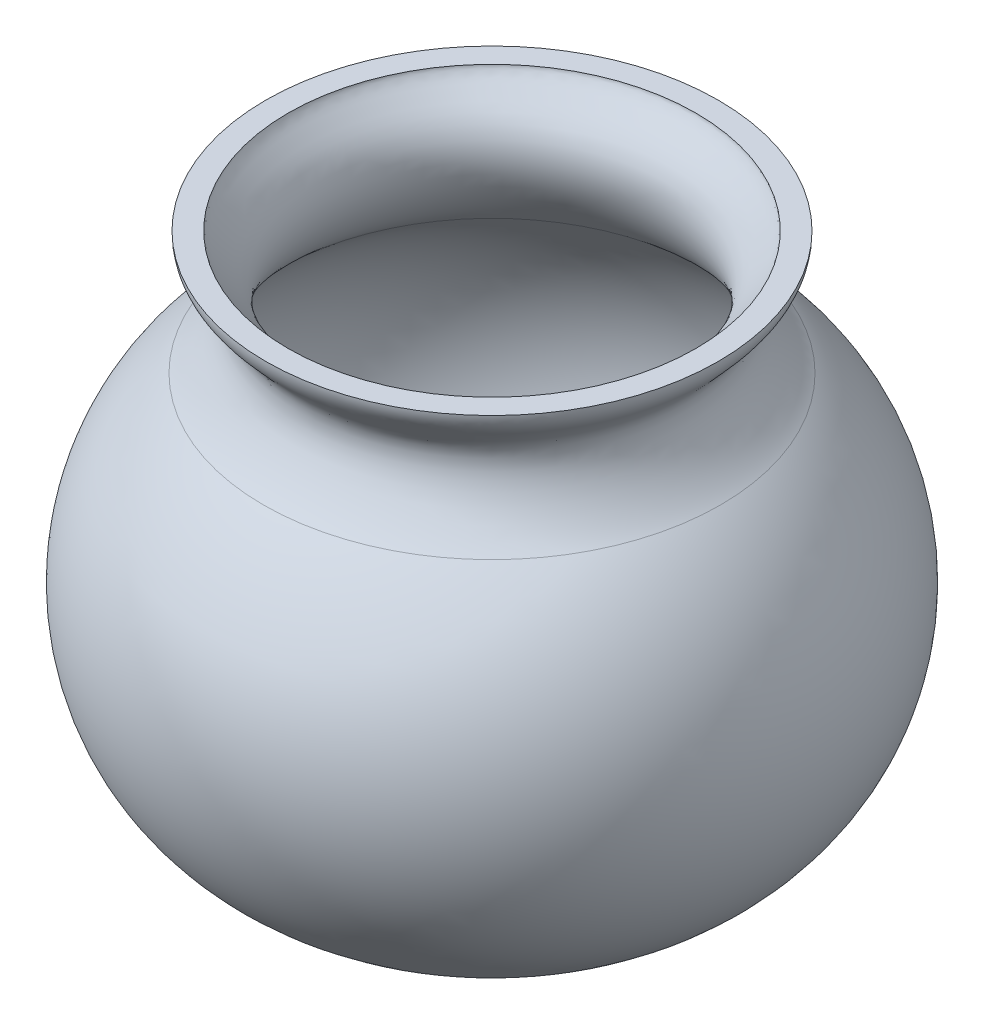
ISO-10303-21;
HEADER;
FILE_DESCRIPTION(('STEP AP214'),'2;1');
FILE_NAME('part.step','',(''),(''),'','','');
FILE_SCHEMA(('AUTOMOTIVE_DESIGN { 1 0 10303 214 1 1 1 1 }'));
ENDSEC;
DATA;
#1=APPLICATION_CONTEXT('core data for automotive mechanical design processes');
#2=APPLICATION_PROTOCOL_DEFINITION('international standard','automotive_design',2000,#1);
#3=PRODUCT_CONTEXT('',#1,'mechanical');
#4=PRODUCT('Part','Part','',(#3));
#5=PRODUCT_RELATED_PRODUCT_CATEGORY('part','',(#4));
#6=PRODUCT_DEFINITION_FORMATION('','',#4);
#7=PRODUCT_DEFINITION_CONTEXT('part definition',#1,'design');
#8=PRODUCT_DEFINITION('design','',#6,#7);
#9=PRODUCT_DEFINITION_SHAPE('','',#8);
#10=(LENGTH_UNIT() NAMED_UNIT(*) SI_UNIT(.MILLI.,.METRE.));
#11=(NAMED_UNIT(*) PLANE_ANGLE_UNIT() SI_UNIT($,.RADIAN.));
#12=(NAMED_UNIT(*) SI_UNIT($,.STERADIAN.) SOLID_ANGLE_UNIT());
#13=UNCERTAINTY_MEASURE_WITH_UNIT(LENGTH_MEASURE(1.E-05),#10,'distance_accuracy_value','');
#14=(GEOMETRIC_REPRESENTATION_CONTEXT(3) GLOBAL_UNCERTAINTY_ASSIGNED_CONTEXT((#13)) GLOBAL_UNIT_ASSIGNED_CONTEXT((#10,
#11,#12)) REPRESENTATION_CONTEXT('',''));
#15=CARTESIAN_POINT('',(0.,0.,0.));
#16=DIRECTION('',(0.,0.,1.));
#17=DIRECTION('',(1.,0.,0.));
#18=AXIS2_PLACEMENT_3D('',#15,#16,#17);
#19=CARTESIAN_POINT('',(17.8417265439225,8.55348735510455,0.));
#20=CARTESIAN_POINT('',(16.3632375000152,9.74064931341441,0.));
#21=CARTESIAN_POINT('',(13.0541570451045,14.3831337431374,0.));
#22=CARTESIAN_POINT('',(17.6760307928761,16.5435492169534,0.));
#23=CARTESIAN_POINT('',(17.6760307928761,18.1852693453129,0.));
#24=B_SPLINE_CURVE_WITH_KNOTS('',3,(#19,#20,#21,#22,#23),.UNSPECIFIED.,.F.,.F.,(4,1,4),(0.,
0.574289637950988,1.),.UNSPECIFIED.);
#25=CARTESIAN_POINT('',(0.,58.5220793921878,0.));
#26=DIRECTION('',(0.,1.,0.));
#27=AXIS1_PLACEMENT('',#25,#26);
#28=SURFACE_OF_REVOLUTION('',#24,#27);
#29=CARTESIAN_POINT('',(0.,18.1852693453129,0.));
#30=DIRECTION('',(0.,1.,0.));
#31=DIRECTION('',(0.,0.,1.));
#32=AXIS2_PLACEMENT_3D('',#29,#30,#31);
#33=CIRCLE('',#32,17.6760307928761);
#34=CARTESIAN_POINT('',(0.,18.1852693453129,17.6760307928761));
#35=VERTEX_POINT('',#34);
#36=EDGE_CURVE('E10',#35,#35,#33,.T.);
#37=ORIENTED_EDGE('',*,*,#36,.F.);
#38=EDGE_LOOP('',(#37));
#39=FACE_BOUND('',#38,.T.);
#40=CARTESIAN_POINT('',(0.,8.55348735510455,0.));
#41=DIRECTION('',(0.,1.,0.));
#42=DIRECTION('',(0.,0.,1.));
#43=AXIS2_PLACEMENT_3D('',#40,#41,#42);
#44=CIRCLE('',#43,17.8417265439225);
#45=CARTESIAN_POINT('',(0.,8.55348735510455,17.8417265439225));
#46=VERTEX_POINT('',#45);
#47=EDGE_CURVE('E56',#46,#46,#44,.T.);
#48=ORIENTED_EDGE('',*,*,#47,.T.);
#49=EDGE_LOOP('',(#48));
#50=FACE_BOUND('',#49,.T.);
#51=ADVANCED_FACE('F33',(#39,#50),#28,.T.);
#52=CARTESIAN_POINT('',(15.9260307928761,18.1852693453129,0.));
#53=DIRECTION('',(0.,-1.,0.));
#54=DIRECTION('',(0.,0.,-1.));
#55=AXIS2_PLACEMENT_3D('',#52,#53,#54);
#56=PLANE('',#55);
#57=CARTESIAN_POINT('',(0.,18.1852693453129,0.));
#58=DIRECTION('',(0.,1.,0.));
#59=DIRECTION('',(0.,0.,1.));
#60=AXIS2_PLACEMENT_3D('',#57,#58,#59);
#61=CIRCLE('',#60,15.9260307928761);
#62=CARTESIAN_POINT('',(0.,18.1852693453129,15.9260307928761));
#63=VERTEX_POINT('',#62);
#64=EDGE_CURVE('E40',#63,#63,#61,.T.);
#65=ORIENTED_EDGE('',*,*,#64,.F.);
#66=EDGE_LOOP('',(#65));
#67=FACE_BOUND('',#66,.T.);
#68=ORIENTED_EDGE('',*,*,#36,.T.);
#69=EDGE_LOOP('',(#68));
#70=FACE_BOUND('',#69,.T.);
#71=ADVANCED_FACE('F75',(#67,#70),#56,.F.);
#72=CARTESIAN_POINT('',(15.9260307928761,18.1852693453129,0.));
#73=CARTESIAN_POINT('',(15.9260307928761,18.1490058291508,0.));
#74=CARTESIAN_POINT('',(15.9221207805379,18.1050170049717,0.));
#75=CARTESIAN_POINT('',(15.8201107027381,17.878855971998,0.));
#76=CARTESIAN_POINT('',(15.5280638653373,17.5011950048872,0.));
#77=CARTESIAN_POINT('',(15.0771484340742,17.0245709720904,0.));
#78=CARTESIAN_POINT('',(14.5265603514551,16.4439110706267,0.));
#79=CARTESIAN_POINT('',(13.9428632410795,15.7270624084047,0.));
#80=CARTESIAN_POINT('',(13.4150785368072,14.695626089205,0.));
#81=CARTESIAN_POINT('',(13.2326041662355,13.5640042034424,0.));
#82=CARTESIAN_POINT('',(13.316734427845,12.5197450245464,0.));
#83=CARTESIAN_POINT('',(13.6628032678733,11.2286412969883,0.));
#84=CARTESIAN_POINT('',(14.396139635518,9.78857024572781,0.));
#85=CARTESIAN_POINT('',(15.3295728499585,8.55560500564795,0.));
#86=CARTESIAN_POINT('',(16.132410921106,7.71592769770157,0.));
#87=CARTESIAN_POINT('',(16.5330490396721,7.35996918805183,0.));
#88=CARTESIAN_POINT('',(16.7460522884572,7.18893690682113,0.));
#89=B_SPLINE_CURVE_WITH_KNOTS('',3,(#72,#73,#74,#75,#76,#77,#78,#79,#80,#81,#82,#83,#84,#85,#86,
#87,#88),.UNSPECIFIED.,.F.,.F.,(4,1,1,1,1,1,1,1,1,1,1,1,1,1,4),(0.,0.0625,0.125,0.1875,0.25,
0.3125,0.375,0.4375,0.5,0.5625,0.625,0.75,0.875,0.9375,1.),.UNSPECIFIED.);
#90=CARTESIAN_POINT('',(0.,58.5220793921878,0.));
#91=DIRECTION('',(0.,1.,0.));
#92=AXIS1_PLACEMENT('',#90,#91);
#93=SURFACE_OF_REVOLUTION('',#89,#92);
#94=CARTESIAN_POINT('',(0.,7.18893690682112,0.));
#95=DIRECTION('',(0.,1.,0.));
#96=DIRECTION('',(0.,0.,1.));
#97=AXIS2_PLACEMENT_3D('',#94,#95,#96);
#98=CIRCLE('',#97,16.7460522884572);
#99=CARTESIAN_POINT('',(0.,7.18893690682112,16.7460522884572));
#100=VERTEX_POINT('',#99);
#101=EDGE_CURVE('E44',#100,#100,#98,.T.);
#102=ORIENTED_EDGE('',*,*,#101,.F.);
#103=EDGE_LOOP('',(#102));
#104=FACE_BOUND('',#103,.T.);
#105=ORIENTED_EDGE('',*,*,#64,.T.);
#106=EDGE_LOOP('',(#105));
#107=FACE_BOUND('',#106,.T.);
#108=ADVANCED_FACE('F71',(#104,#107),#93,.T.);
#109=CARTESIAN_POINT('',(0.,-5.57540363425461,0.));
#110=DIRECTION('',(0.,1.,0.));
#111=DIRECTION('',(0.,0.,1.));
#112=AXIS2_PLACEMENT_3D('',#109,#110,#111);
#113=DEGENERATE_TOROIDAL_SURFACE('',#112,6.49684579232299,16.3699304595025,.T.);
#114=CARTESIAN_POINT('',(0.,-21.9453340937571,0.));
#115=DIRECTION('',(0.,1.,0.));
#116=DIRECTION('',(0.,0.,1.));
#117=AXIS2_PLACEMENT_3D('',#114,#115,#116);
#118=CIRCLE('',#117,6.49684579232299);
#119=CARTESIAN_POINT('',(0.,-21.9453340937571,6.49684579232299));
#120=VERTEX_POINT('',#119);
#121=EDGE_CURVE('E48',#120,#120,#118,.T.);
#122=ORIENTED_EDGE('',*,*,#121,.F.);
#123=EDGE_LOOP('',(#122));
#124=FACE_BOUND('',#123,.T.);
#125=ORIENTED_EDGE('',*,*,#101,.T.);
#126=EDGE_LOOP('',(#125));
#127=FACE_BOUND('',#126,.T.);
#128=ADVANCED_FACE('F74',(#124,#127),#113,.F.);
#129=CARTESIAN_POINT('',(0.,-21.9453340937571,0.));
#130=DIRECTION('',(0.,-1.,0.));
#131=DIRECTION('',(0.,0.,-1.));
#132=AXIS2_PLACEMENT_3D('',#129,#130,#131);
#133=PLANE('',#132);
#134=CARTESIAN_POINT('',(-2.25,-21.9453340937571,2.25));
#135=DIRECTION('',(0.,-1.,0.));
#136=DIRECTION('',(0.,0.,-1.));
#137=AXIS2_PLACEMENT_3D('',#134,#135,#136);
#138=CIRCLE('',#137,1.25);
#139=CARTESIAN_POINT('',(-2.25,-21.9453340937571,1.));
#140=VERTEX_POINT('',#139);
#141=EDGE_CURVE('E142',#140,#140,#138,.F.);
#142=ORIENTED_EDGE('',*,*,#141,.F.);
#143=EDGE_LOOP('',(#142));
#144=FACE_BOUND('',#143,.T.);
#145=CARTESIAN_POINT('',(2.25,-21.9453340937571,-2.25));
#146=DIRECTION('',(0.,-1.,0.));
#147=DIRECTION('',(0.,0.,-1.));
#148=AXIS2_PLACEMENT_3D('',#145,#146,#147);
#149=CIRCLE('',#148,1.25);
#150=CARTESIAN_POINT('',(2.25,-21.9453340937571,-3.5));
#151=VERTEX_POINT('',#150);
#152=EDGE_CURVE('E135',#151,#151,#149,.F.);
#153=ORIENTED_EDGE('',*,*,#152,.F.);
#154=EDGE_LOOP('',(#153));
#155=FACE_BOUND('',#154,.T.);
#156=CARTESIAN_POINT('',(-2.25,-21.9453340937571,-2.25));
#157=DIRECTION('',(0.,-1.,0.));
#158=DIRECTION('',(0.,0.,-1.));
#159=AXIS2_PLACEMENT_3D('',#156,#157,#158);
#160=CIRCLE('',#159,1.25);
#161=CARTESIAN_POINT('',(-2.25,-21.9453340937571,-3.5));
#162=VERTEX_POINT('',#161);
#163=EDGE_CURVE('E130',#162,#162,#160,.F.);
#164=ORIENTED_EDGE('',*,*,#163,.F.);
#165=EDGE_LOOP('',(#164));
#166=FACE_BOUND('',#165,.T.);
#167=CARTESIAN_POINT('',(2.25,-21.9453340937571,2.25));
#168=DIRECTION('',(0.,-1.,0.));
#169=DIRECTION('',(0.,0.,-1.));
#170=AXIS2_PLACEMENT_3D('',#167,#168,#169);
#171=CIRCLE('',#170,1.25);
#172=CARTESIAN_POINT('',(2.25,-21.9453340937571,1.));
#173=VERTEX_POINT('',#172);
#174=EDGE_CURVE('E59',#173,#173,#171,.F.);
#175=ORIENTED_EDGE('',*,*,#174,.F.);
#176=EDGE_LOOP('',(#175));
#177=FACE_BOUND('',#176,.T.);
#178=ORIENTED_EDGE('',*,*,#121,.T.);
#179=EDGE_LOOP('',(#178));
#180=FACE_BOUND('',#179,.T.);
#181=ADVANCED_FACE('F98',(#144,#155,#166,#177,#180),#133,.F.);
#182=CARTESIAN_POINT('',(0.,-23.6953340937571,0.));
#183=DIRECTION('',(0.,1.,0.));
#184=DIRECTION('',(0.,0.,1.));
#185=AXIS2_PLACEMENT_3D('',#182,#183,#184);
#186=PLANE('',#185);
#187=CARTESIAN_POINT('',(-2.25,-23.6953340937571,2.25));
#188=DIRECTION('',(0.,-1.,0.));
#189=DIRECTION('',(0.,0.,1.));
#190=AXIS2_PLACEMENT_3D('',#187,#188,#189);
#191=CIRCLE('',#190,1.25);
#192=CARTESIAN_POINT('',(-2.25,-23.6953340937571,3.5));
#193=VERTEX_POINT('',#192);
#194=EDGE_CURVE('E139',#193,#193,#191,.T.);
#195=ORIENTED_EDGE('',*,*,#194,.F.);
#196=EDGE_LOOP('',(#195));
#197=FACE_BOUND('',#196,.T.);
#198=CARTESIAN_POINT('',(2.25,-23.6953340937571,-2.25));
#199=DIRECTION('',(0.,-1.,0.));
#200=DIRECTION('',(0.,0.,1.));
#201=AXIS2_PLACEMENT_3D('',#198,#199,#200);
#202=CIRCLE('',#201,1.25);
#203=CARTESIAN_POINT('',(2.25,-23.6953340937571,-1.));
#204=VERTEX_POINT('',#203);
#205=EDGE_CURVE('E132',#204,#204,#202,.T.);
#206=ORIENTED_EDGE('',*,*,#205,.F.);
#207=EDGE_LOOP('',(#206));
#208=FACE_BOUND('',#207,.T.);
#209=CARTESIAN_POINT('',(-2.25,-23.6953340937571,-2.25));
#210=DIRECTION('',(0.,-1.,0.));
#211=DIRECTION('',(0.,0.,-1.));
#212=AXIS2_PLACEMENT_3D('',#209,#210,#211);
#213=CIRCLE('',#212,1.25);
#214=CARTESIAN_POINT('',(-2.25,-23.6953340937571,-3.5));
#215=VERTEX_POINT('',#214);
#216=EDGE_CURVE('E127',#215,#215,#213,.T.);
#217=ORIENTED_EDGE('',*,*,#216,.F.);
#218=EDGE_LOOP('',(#217));
#219=FACE_BOUND('',#218,.T.);
#220=CARTESIAN_POINT('',(2.25,-23.6953340937571,2.25));
#221=DIRECTION('',(0.,-1.,0.));
#222=DIRECTION('',(0.,0.,-1.));
#223=AXIS2_PLACEMENT_3D('',#220,#221,#222);
#224=CIRCLE('',#223,1.25);
#225=CARTESIAN_POINT('',(2.25,-23.6953340937571,1.));
#226=VERTEX_POINT('',#225);
#227=EDGE_CURVE('E144',#226,#226,#224,.T.);
#228=ORIENTED_EDGE('',*,*,#227,.F.);
#229=EDGE_LOOP('',(#228));
#230=FACE_BOUND('',#229,.T.);
#231=CARTESIAN_POINT('',(0.,-23.6953340937571,0.));
#232=DIRECTION('',(0.,1.,0.));
#233=DIRECTION('',(0.,0.,1.));
#234=AXIS2_PLACEMENT_3D('',#231,#232,#233);
#235=CIRCLE('',#234,6.49684579232299);
#236=CARTESIAN_POINT('',(0.,-23.6953340937571,6.49684579232299));
#237=VERTEX_POINT('',#236);
#238=EDGE_CURVE('E53',#237,#237,#235,.T.);
#239=ORIENTED_EDGE('',*,*,#238,.F.);
#240=EDGE_LOOP('',(#239));
#241=FACE_BOUND('',#240,.T.);
#242=ADVANCED_FACE('F93',(#197,#208,#219,#230,#241),#186,.F.);
#243=CARTESIAN_POINT('',(0.,-5.57540363425461,0.));
#244=DIRECTION('',(0.,1.,0.));
#245=DIRECTION('',(0.,0.,1.));
#246=AXIS2_PLACEMENT_3D('',#243,#244,#245);
#247=DEGENERATE_TOROIDAL_SURFACE('',#246,6.49684579232299,18.1199304595025,.T.);
#248=ORIENTED_EDGE('',*,*,#47,.F.);
#249=EDGE_LOOP('',(#248));
#250=FACE_BOUND('',#249,.T.);
#251=ORIENTED_EDGE('',*,*,#238,.T.);
#252=EDGE_LOOP('',(#251));
#253=FACE_BOUND('',#252,.T.);
#254=ADVANCED_FACE('F89',(#250,#253),#247,.T.);
#255=CARTESIAN_POINT('',(2.25,18.1862693453129,2.25));
#256=DIRECTION('',(0.,-1.,0.));
#257=DIRECTION('',(0.,0.,-1.));
#258=AXIS2_PLACEMENT_3D('',#255,#256,#257);
#259=CYLINDRICAL_SURFACE('',#258,1.25);
#260=ORIENTED_EDGE('',*,*,#227,.T.);
#261=EDGE_LOOP('',(#260));
#262=FACE_BOUND('',#261,.T.);
#263=ORIENTED_EDGE('',*,*,#174,.T.);
#264=EDGE_LOOP('',(#263));
#265=FACE_BOUND('',#264,.T.);
#266=ADVANCED_FACE('F92',(#262,#265),#259,.F.);
#267=CARTESIAN_POINT('',(-2.25,18.1862693453129,-2.25));
#268=DIRECTION('',(0.,-1.,0.));
#269=DIRECTION('',(0.,0.,-1.));
#270=AXIS2_PLACEMENT_3D('',#267,#268,#269);
#271=CYLINDRICAL_SURFACE('',#270,1.25);
#272=ORIENTED_EDGE('',*,*,#216,.T.);
#273=EDGE_LOOP('',(#272));
#274=FACE_BOUND('',#273,.T.);
#275=ORIENTED_EDGE('',*,*,#163,.T.);
#276=EDGE_LOOP('',(#275));
#277=FACE_BOUND('',#276,.T.);
#278=ADVANCED_FACE('F110',(#274,#277),#271,.F.);
#279=CARTESIAN_POINT('',(2.25,18.1862693453129,-2.25));
#280=DIRECTION('',(0.,-1.,0.));
#281=DIRECTION('',(0.,0.,-1.));
#282=AXIS2_PLACEMENT_3D('',#279,#280,#281);
#283=CYLINDRICAL_SURFACE('',#282,1.25);
#284=ORIENTED_EDGE('',*,*,#205,.T.);
#285=EDGE_LOOP('',(#284));
#286=FACE_BOUND('',#285,.T.);
#287=ORIENTED_EDGE('',*,*,#152,.T.);
#288=EDGE_LOOP('',(#287));
#289=FACE_BOUND('',#288,.T.);
#290=ADVANCED_FACE('F112',(#286,#289),#283,.F.);
#291=CARTESIAN_POINT('',(-2.25,18.1862693453129,2.25));
#292=DIRECTION('',(0.,-1.,0.));
#293=DIRECTION('',(0.,0.,-1.));
#294=AXIS2_PLACEMENT_3D('',#291,#292,#293);
#295=CYLINDRICAL_SURFACE('',#294,1.25);
#296=ORIENTED_EDGE('',*,*,#194,.T.);
#297=EDGE_LOOP('',(#296));
#298=FACE_BOUND('',#297,.T.);
#299=ORIENTED_EDGE('',*,*,#141,.T.);
#300=EDGE_LOOP('',(#299));
#301=FACE_BOUND('',#300,.T.);
#302=ADVANCED_FACE('F115',(#298,#301),#295,.F.);
#303=CLOSED_SHELL('',(#51,#71,#108,#128,#181,#242,#254,#266,#278,#290,#302));
#304=MANIFOLD_SOLID_BREP('B2',#303);
#305=ADVANCED_BREP_SHAPE_REPRESENTATION('',(#18,#304),#14);
#306=SHAPE_DEFINITION_REPRESENTATION(#9,#305);
ENDSEC;
END-ISO-10303-21;
